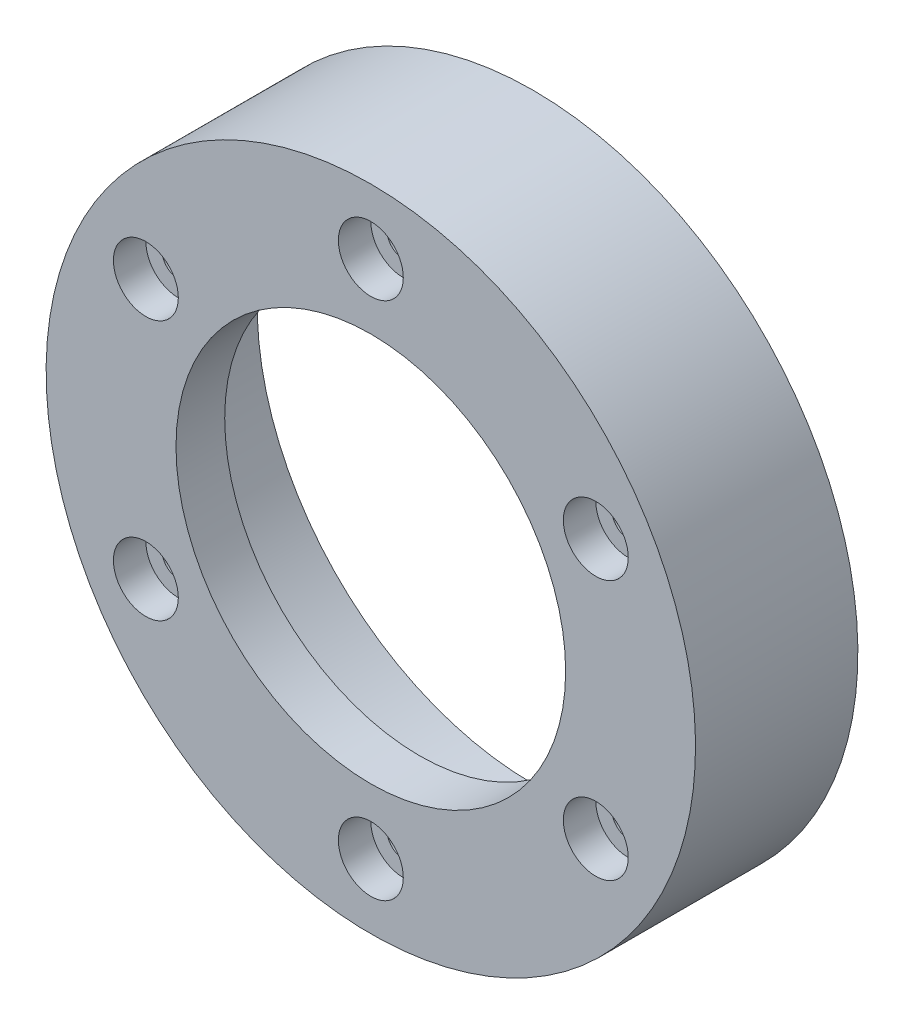
ISO-10303-21;
HEADER;
FILE_DESCRIPTION(('STEP AP214'),'2;1');
FILE_NAME('part.step','',(''),(''),'','','');
FILE_SCHEMA(('AUTOMOTIVE_DESIGN { 1 0 10303 214 1 1 1 1 }'));
ENDSEC;
DATA;
#1=APPLICATION_CONTEXT('core data for automotive mechanical design processes');
#2=APPLICATION_PROTOCOL_DEFINITION('international standard','automotive_design',2000,#1);
#3=PRODUCT_CONTEXT('',#1,'mechanical');
#4=PRODUCT('Part','Part','',(#3));
#5=PRODUCT_RELATED_PRODUCT_CATEGORY('part','',(#4));
#6=PRODUCT_DEFINITION_FORMATION('','',#4);
#7=PRODUCT_DEFINITION_CONTEXT('part definition',#1,'design');
#8=PRODUCT_DEFINITION('design','',#6,#7);
#9=PRODUCT_DEFINITION_SHAPE('','',#8);
#10=(LENGTH_UNIT() NAMED_UNIT(*) SI_UNIT(.MILLI.,.METRE.));
#11=(NAMED_UNIT(*) PLANE_ANGLE_UNIT() SI_UNIT($,.RADIAN.));
#12=(NAMED_UNIT(*) SI_UNIT($,.STERADIAN.) SOLID_ANGLE_UNIT());
#13=UNCERTAINTY_MEASURE_WITH_UNIT(LENGTH_MEASURE(1.E-05),#10,'distance_accuracy_value','');
#14=(GEOMETRIC_REPRESENTATION_CONTEXT(3) GLOBAL_UNCERTAINTY_ASSIGNED_CONTEXT((#13)) GLOBAL_UNIT_ASSIGNED_CONTEXT((#10,
#11,#12)) REPRESENTATION_CONTEXT('',''));
#15=CARTESIAN_POINT('',(0.,0.,0.));
#16=DIRECTION('',(0.,0.,1.));
#17=DIRECTION('',(1.,0.,0.));
#18=AXIS2_PLACEMENT_3D('',#15,#16,#17);
#19=CARTESIAN_POINT('',(0.,31.75,7.93750000000001));
#20=DIRECTION('',(0.,0.,1.));
#21=DIRECTION('',(0.,-1.,0.));
#22=AXIS2_PLACEMENT_3D('',#19,#20,#21);
#23=PLANE('',#22);
#24=CARTESIAN_POINT('',(0.,25.4,7.9375));
#25=DIRECTION('',(0.,0.,1.));
#26=DIRECTION('',(1.,0.,0.));
#27=AXIS2_PLACEMENT_3D('',#24,#25,#26);
#28=CIRCLE('',#27,3.175);
#29=CARTESIAN_POINT('',(3.175,25.4,7.9375));
#30=VERTEX_POINT('',#29);
#31=EDGE_CURVE('E201',#30,#30,#28,.T.);
#32=ORIENTED_EDGE('',*,*,#31,.F.);
#33=EDGE_LOOP('',(#32));
#34=FACE_BOUND('',#33,.T.);
#35=CARTESIAN_POINT('',(21.9970452561247,12.7,7.9375));
#36=DIRECTION('',(0.,0.,1.));
#37=DIRECTION('',(1.,0.,0.));
#38=AXIS2_PLACEMENT_3D('',#35,#36,#37);
#39=CIRCLE('',#38,3.175);
#40=CARTESIAN_POINT('',(25.1720452561247,12.7,7.9375));
#41=VERTEX_POINT('',#40);
#42=EDGE_CURVE('E208',#41,#41,#39,.T.);
#43=ORIENTED_EDGE('',*,*,#42,.F.);
#44=EDGE_LOOP('',(#43));
#45=FACE_BOUND('',#44,.T.);
#46=CARTESIAN_POINT('',(21.9970452561247,-12.7,7.9375));
#47=DIRECTION('',(0.,0.,1.));
#48=DIRECTION('',(1.,0.,0.));
#49=AXIS2_PLACEMENT_3D('',#46,#47,#48);
#50=CIRCLE('',#49,3.175);
#51=CARTESIAN_POINT('',(25.1720452561247,-12.7,7.9375));
#52=VERTEX_POINT('',#51);
#53=EDGE_CURVE('E219',#52,#52,#50,.T.);
#54=ORIENTED_EDGE('',*,*,#53,.F.);
#55=EDGE_LOOP('',(#54));
#56=FACE_BOUND('',#55,.T.);
#57=CARTESIAN_POINT('',(0.,-25.4,7.9375));
#58=DIRECTION('',(0.,0.,1.));
#59=DIRECTION('',(1.,0.,0.));
#60=AXIS2_PLACEMENT_3D('',#57,#58,#59);
#61=CIRCLE('',#60,3.175);
#62=CARTESIAN_POINT('',(3.175,-25.4,7.9375));
#63=VERTEX_POINT('',#62);
#64=EDGE_CURVE('E231',#63,#63,#61,.T.);
#65=ORIENTED_EDGE('',*,*,#64,.F.);
#66=EDGE_LOOP('',(#65));
#67=FACE_BOUND('',#66,.T.);
#68=CARTESIAN_POINT('',(-21.9970452561247,-12.7,7.9375));
#69=DIRECTION('',(0.,0.,1.));
#70=DIRECTION('',(1.,0.,0.));
#71=AXIS2_PLACEMENT_3D('',#68,#69,#70);
#72=CIRCLE('',#71,3.175);
#73=CARTESIAN_POINT('',(-18.8220452561247,-12.7,7.9375));
#74=VERTEX_POINT('',#73);
#75=EDGE_CURVE('E243',#74,#74,#72,.T.);
#76=ORIENTED_EDGE('',*,*,#75,.F.);
#77=EDGE_LOOP('',(#76));
#78=FACE_BOUND('',#77,.T.);
#79=CARTESIAN_POINT('',(-21.9970452561247,12.7,7.9375));
#80=DIRECTION('',(0.,0.,1.));
#81=DIRECTION('',(1.,0.,0.));
#82=AXIS2_PLACEMENT_3D('',#79,#80,#81);
#83=CIRCLE('',#82,3.175);
#84=CARTESIAN_POINT('',(-18.8220452561247,12.7,7.9375));
#85=VERTEX_POINT('',#84);
#86=EDGE_CURVE('E253',#85,#85,#83,.T.);
#87=ORIENTED_EDGE('',*,*,#86,.F.);
#88=EDGE_LOOP('',(#87));
#89=FACE_BOUND('',#88,.T.);
#90=CARTESIAN_POINT('',(0.,0.,7.9375));
#91=DIRECTION('',(0.,0.,-1.));
#92=DIRECTION('',(0.,1.,0.));
#93=AXIS2_PLACEMENT_3D('',#90,#91,#92);
#94=CIRCLE('',#93,19.05);
#95=CARTESIAN_POINT('',(0.,19.05,7.93750000000001));
#96=VERTEX_POINT('',#95);
#97=EDGE_CURVE('E85',#96,#96,#94,.T.);
#98=ORIENTED_EDGE('',*,*,#97,.T.);
#99=EDGE_LOOP('',(#98));
#100=FACE_BOUND('',#99,.T.);
#101=CARTESIAN_POINT('',(0.,0.,7.9375));
#102=DIRECTION('',(0.,0.,-1.));
#103=DIRECTION('',(0.,1.,0.));
#104=AXIS2_PLACEMENT_3D('',#101,#102,#103);
#105=CIRCLE('',#104,31.75);
#106=CARTESIAN_POINT('',(0.,31.75,7.93750000000001));
#107=VERTEX_POINT('',#106);
#108=EDGE_CURVE('E11',#107,#107,#105,.T.);
#109=ORIENTED_EDGE('',*,*,#108,.F.);
#110=EDGE_LOOP('',(#109));
#111=FACE_BOUND('',#110,.T.);
#112=ADVANCED_FACE('F33',(#34,#45,#56,#67,#78,#89,#100,#111),#23,.T.);
#113=CARTESIAN_POINT('',(0.,0.,-7.93750000000001));
#114=DIRECTION('',(0.,0.,-1.));
#115=DIRECTION('',(0.,1.,0.));
#116=AXIS2_PLACEMENT_3D('',#113,#114,#115);
#117=CYLINDRICAL_SURFACE('',#116,31.75);
#118=ORIENTED_EDGE('',*,*,#108,.T.);
#119=EDGE_LOOP('',(#118));
#120=FACE_BOUND('',#119,.T.);
#121=CARTESIAN_POINT('',(0.,0.,-7.9375));
#122=DIRECTION('',(0.,0.,-1.));
#123=DIRECTION('',(0.,1.,0.));
#124=AXIS2_PLACEMENT_3D('',#121,#122,#123);
#125=CIRCLE('',#124,31.75);
#126=CARTESIAN_POINT('',(0.,31.75,-7.93749999999999));
#127=VERTEX_POINT('',#126);
#128=EDGE_CURVE('E41',#127,#127,#125,.T.);
#129=ORIENTED_EDGE('',*,*,#128,.F.);
#130=EDGE_LOOP('',(#129));
#131=FACE_BOUND('',#130,.T.);
#132=ADVANCED_FACE('F106',(#120,#131),#117,.T.);
#133=CARTESIAN_POINT('',(0.,31.75,-7.93749999999999));
#134=DIRECTION('',(0.,0.,-1.));
#135=DIRECTION('',(0.,1.,0.));
#136=AXIS2_PLACEMENT_3D('',#133,#134,#135);
#137=PLANE('',#136);
#138=ORIENTED_EDGE('',*,*,#128,.T.);
#139=EDGE_LOOP('',(#138));
#140=FACE_BOUND('',#139,.T.);
#141=CARTESIAN_POINT('',(0.,0.,-7.93750000000001));
#142=DIRECTION('',(0.,0.,-1.));
#143=DIRECTION('',(0.,1.,0.));
#144=AXIS2_PLACEMENT_3D('',#141,#142,#143);
#145=CIRCLE('',#144,26.9875);
#146=CARTESIAN_POINT('',(0.,26.9875,-7.9375));
#147=VERTEX_POINT('',#146);
#148=EDGE_CURVE('E97',#147,#147,#145,.T.);
#149=ORIENTED_EDGE('',*,*,#148,.F.);
#150=EDGE_LOOP('',(#149));
#151=FACE_BOUND('',#150,.T.);
#152=ADVANCED_FACE('F103',(#140,#151),#137,.T.);
#153=CARTESIAN_POINT('',(0.,0.,-7.93750000000001));
#154=DIRECTION('',(0.,0.,-1.));
#155=DIRECTION('',(0.,1.,0.));
#156=AXIS2_PLACEMENT_3D('',#153,#154,#155);
#157=CYLINDRICAL_SURFACE('',#156,26.9875);
#158=CARTESIAN_POINT('',(0.,0.,3.175));
#159=DIRECTION('',(0.,0.,-1.));
#160=DIRECTION('',(0.,1.,0.));
#161=AXIS2_PLACEMENT_3D('',#158,#159,#160);
#162=CIRCLE('',#161,26.9875);
#163=CARTESIAN_POINT('',(0.,26.9875,3.17500000000001));
#164=VERTEX_POINT('',#163);
#165=CARTESIAN_POINT('',(23.3718605846325,13.49375,3.175));
#166=VERTEX_POINT('',#165);
#167=EDGE_CURVE('E51',#164,#166,#162,.T.);
#168=ORIENTED_EDGE('',*,*,#167,.F.);
#169=CARTESIAN_POINT('',(-23.3718605846325,13.49375,3.175));
#170=VERTEX_POINT('',#169);
#171=EDGE_CURVE('E81',#170,#164,#162,.T.);
#172=ORIENTED_EDGE('',*,*,#171,.F.);
#173=CARTESIAN_POINT('',(-23.3718605846325,-13.49375,3.17499999999999));
#174=VERTEX_POINT('',#173);
#175=EDGE_CURVE('E67',#174,#170,#162,.T.);
#176=ORIENTED_EDGE('',*,*,#175,.F.);
#177=CARTESIAN_POINT('',(0.,-26.9875,3.17499999999999));
#178=VERTEX_POINT('',#177);
#179=EDGE_CURVE('E78',#178,#174,#162,.T.);
#180=ORIENTED_EDGE('',*,*,#179,.F.);
#181=CARTESIAN_POINT('',(23.3718605846325,-13.49375,3.17499999999999));
#182=VERTEX_POINT('',#181);
#183=EDGE_CURVE('E277',#182,#178,#162,.T.);
#184=ORIENTED_EDGE('',*,*,#183,.F.);
#185=EDGE_CURVE('E280',#166,#182,#162,.T.);
#186=ORIENTED_EDGE('',*,*,#185,.F.);
#187=EDGE_LOOP('',(#168,#172,#176,#180,#184,#186));
#188=FACE_BOUND('',#187,.T.);
#189=ORIENTED_EDGE('',*,*,#148,.T.);
#190=EDGE_LOOP('',(#189));
#191=FACE_BOUND('',#190,.T.);
#192=ADVANCED_FACE('F113',(#188,#191),#157,.F.);
#193=CARTESIAN_POINT('',(0.,26.9875,3.17500000000001));
#194=DIRECTION('',(0.,0.,-1.));
#195=DIRECTION('',(0.,1.,0.));
#196=AXIS2_PLACEMENT_3D('',#193,#194,#195);
#197=PLANE('',#196);
#198=ORIENTED_EDGE('',*,*,#171,.T.);
#199=CARTESIAN_POINT('',(0.,25.4,3.17500000000001));
#200=DIRECTION('',(0.,0.,-1.));
#201=DIRECTION('',(0.,1.,0.));
#202=AXIS2_PLACEMENT_3D('',#199,#200,#201);
#203=CIRCLE('',#202,1.5875);
#204=EDGE_CURVE('E36',#164,#164,#203,.T.);
#205=ORIENTED_EDGE('',*,*,#204,.F.);
#206=ORIENTED_EDGE('',*,*,#167,.T.);
#207=CARTESIAN_POINT('',(21.9970452561247,12.7,3.175));
#208=DIRECTION('',(0.,0.,-1.));
#209=DIRECTION('',(0.,1.,0.));
#210=AXIS2_PLACEMENT_3D('',#207,#208,#209);
#211=CIRCLE('',#210,1.5875);
#212=EDGE_CURVE('E217',#166,#166,#211,.T.);
#213=ORIENTED_EDGE('',*,*,#212,.F.);
#214=ORIENTED_EDGE('',*,*,#185,.T.);
#215=CARTESIAN_POINT('',(21.9970452561247,-12.7,3.175));
#216=DIRECTION('',(0.,0.,-1.));
#217=DIRECTION('',(0.,1.,0.));
#218=AXIS2_PLACEMENT_3D('',#215,#216,#217);
#219=CIRCLE('',#218,1.5875);
#220=EDGE_CURVE('E228',#182,#182,#219,.T.);
#221=ORIENTED_EDGE('',*,*,#220,.F.);
#222=ORIENTED_EDGE('',*,*,#183,.T.);
#223=CARTESIAN_POINT('',(0.,-25.4,3.17499999999999));
#224=DIRECTION('',(0.,0.,-1.));
#225=DIRECTION('',(0.,1.,0.));
#226=AXIS2_PLACEMENT_3D('',#223,#224,#225);
#227=CIRCLE('',#226,1.5875);
#228=EDGE_CURVE('E240',#178,#178,#227,.T.);
#229=ORIENTED_EDGE('',*,*,#228,.F.);
#230=ORIENTED_EDGE('',*,*,#179,.T.);
#231=CARTESIAN_POINT('',(-21.9970452561247,-12.7,3.175));
#232=DIRECTION('',(0.,0.,-1.));
#233=DIRECTION('',(0.,1.,0.));
#234=AXIS2_PLACEMENT_3D('',#231,#232,#233);
#235=CIRCLE('',#234,1.5875);
#236=EDGE_CURVE('E75',#174,#174,#235,.T.);
#237=ORIENTED_EDGE('',*,*,#236,.F.);
#238=ORIENTED_EDGE('',*,*,#175,.T.);
#239=CARTESIAN_POINT('',(-21.9970452561247,12.7,3.175));
#240=DIRECTION('',(0.,0.,-1.));
#241=DIRECTION('',(0.,1.,0.));
#242=AXIS2_PLACEMENT_3D('',#239,#240,#241);
#243=CIRCLE('',#242,1.5875);
#244=EDGE_CURVE('E72',#170,#170,#243,.T.);
#245=ORIENTED_EDGE('',*,*,#244,.F.);
#246=EDGE_LOOP('',(#198,#205,#206,#213,#214,#221,#222,#229,#230,#237,#238,#245));
#247=FACE_BOUND('',#246,.T.);
#248=CARTESIAN_POINT('',(0.,0.,3.175));
#249=DIRECTION('',(0.,0.,-1.));
#250=DIRECTION('',(0.,1.,0.));
#251=AXIS2_PLACEMENT_3D('',#248,#249,#250);
#252=CIRCLE('',#251,19.05);
#253=CARTESIAN_POINT('',(0.,19.05,3.17500000000001));
#254=VERTEX_POINT('',#253);
#255=EDGE_CURVE('E79',#254,#254,#252,.T.);
#256=ORIENTED_EDGE('',*,*,#255,.F.);
#257=EDGE_LOOP('',(#256));
#258=FACE_BOUND('',#257,.T.);
#259=ADVANCED_FACE('F70',(#247,#258),#197,.T.);
#260=CARTESIAN_POINT('',(0.,0.,-7.93750000000001));
#261=DIRECTION('',(0.,0.,-1.));
#262=DIRECTION('',(0.,1.,0.));
#263=AXIS2_PLACEMENT_3D('',#260,#261,#262);
#264=CYLINDRICAL_SURFACE('',#263,19.05);
#265=ORIENTED_EDGE('',*,*,#255,.T.);
#266=EDGE_LOOP('',(#265));
#267=FACE_BOUND('',#266,.T.);
#268=ORIENTED_EDGE('',*,*,#97,.F.);
#269=EDGE_LOOP('',(#268));
#270=FACE_BOUND('',#269,.T.);
#271=ADVANCED_FACE('F121',(#267,#270),#264,.F.);
#272=CARTESIAN_POINT('',(-21.9970452561247,12.7,7.9375));
#273=DIRECTION('',(0.,0.,1.));
#274=DIRECTION('',(1.,0.,0.));
#275=AXIS2_PLACEMENT_3D('',#272,#273,#274);
#276=CYLINDRICAL_SURFACE('',#275,1.5875);
#277=ORIENTED_EDGE('',*,*,#244,.T.);
#278=EDGE_LOOP('',(#277));
#279=FACE_BOUND('',#278,.T.);
#280=CARTESIAN_POINT('',(-21.9970452561247,12.7,4.7625));
#281=DIRECTION('',(0.,0.,1.));
#282=DIRECTION('',(1.,0.,0.));
#283=AXIS2_PLACEMENT_3D('',#280,#281,#282);
#284=CIRCLE('',#283,1.5875);
#285=CARTESIAN_POINT('',(-20.4095452561247,12.7,4.7625));
#286=VERTEX_POINT('',#285);
#287=EDGE_CURVE('E86',#286,#286,#284,.T.);
#288=ORIENTED_EDGE('',*,*,#287,.T.);
#289=EDGE_LOOP('',(#288));
#290=FACE_BOUND('',#289,.T.);
#291=ADVANCED_FACE('F83',(#279,#290),#276,.F.);
#292=CARTESIAN_POINT('',(-20.4095452561247,12.7,4.7625));
#293=DIRECTION('',(0.,0.,-1.));
#294=DIRECTION('',(-1.,0.,0.));
#295=AXIS2_PLACEMENT_3D('',#292,#293,#294);
#296=PLANE('',#295);
#297=ORIENTED_EDGE('',*,*,#287,.F.);
#298=EDGE_LOOP('',(#297));
#299=FACE_BOUND('',#298,.T.);
#300=CARTESIAN_POINT('',(-21.9970452561247,12.7,4.7625));
#301=DIRECTION('',(0.,0.,1.));
#302=DIRECTION('',(1.,0.,0.));
#303=AXIS2_PLACEMENT_3D('',#300,#301,#302);
#304=CIRCLE('',#303,3.175);
#305=CARTESIAN_POINT('',(-18.8220452561247,12.7,4.7625));
#306=VERTEX_POINT('',#305);
#307=EDGE_CURVE('E91',#306,#306,#304,.T.);
#308=ORIENTED_EDGE('',*,*,#307,.T.);
#309=EDGE_LOOP('',(#308));
#310=FACE_BOUND('',#309,.T.);
#311=ADVANCED_FACE('F127',(#299,#310),#296,.F.);
#312=CARTESIAN_POINT('',(-21.9970452561247,12.7,7.9375));
#313=DIRECTION('',(0.,0.,1.));
#314=DIRECTION('',(1.,0.,0.));
#315=AXIS2_PLACEMENT_3D('',#312,#313,#314);
#316=CYLINDRICAL_SURFACE('',#315,3.175);
#317=ORIENTED_EDGE('',*,*,#307,.F.);
#318=EDGE_LOOP('',(#317));
#319=FACE_BOUND('',#318,.T.);
#320=ORIENTED_EDGE('',*,*,#86,.T.);
#321=EDGE_LOOP('',(#320));
#322=FACE_BOUND('',#321,.T.);
#323=ADVANCED_FACE('F130',(#319,#322),#316,.F.);
#324=CARTESIAN_POINT('',(-21.9970452561247,-12.7,7.9375));
#325=DIRECTION('',(0.,0.,1.));
#326=DIRECTION('',(1.,0.,0.));
#327=AXIS2_PLACEMENT_3D('',#324,#325,#326);
#328=CYLINDRICAL_SURFACE('',#327,1.5875);
#329=ORIENTED_EDGE('',*,*,#236,.T.);
#330=EDGE_LOOP('',(#329));
#331=FACE_BOUND('',#330,.T.);
#332=CARTESIAN_POINT('',(-21.9970452561247,-12.7,4.7625));
#333=DIRECTION('',(0.,0.,1.));
#334=DIRECTION('',(1.,0.,0.));
#335=AXIS2_PLACEMENT_3D('',#332,#333,#334);
#336=CIRCLE('',#335,1.5875);
#337=CARTESIAN_POINT('',(-20.4095452561247,-12.7,4.7625));
#338=VERTEX_POINT('',#337);
#339=EDGE_CURVE('E249',#338,#338,#336,.T.);
#340=ORIENTED_EDGE('',*,*,#339,.T.);
#341=EDGE_LOOP('',(#340));
#342=FACE_BOUND('',#341,.T.);
#343=ADVANCED_FACE('F134',(#331,#342),#328,.F.);
#344=CARTESIAN_POINT('',(-20.4095452561247,-12.7,4.7625));
#345=DIRECTION('',(0.,0.,-1.));
#346=DIRECTION('',(-1.,0.,0.));
#347=AXIS2_PLACEMENT_3D('',#344,#345,#346);
#348=PLANE('',#347);
#349=ORIENTED_EDGE('',*,*,#339,.F.);
#350=EDGE_LOOP('',(#349));
#351=FACE_BOUND('',#350,.T.);
#352=CARTESIAN_POINT('',(-21.9970452561247,-12.7,4.7625));
#353=DIRECTION('',(0.,0.,1.));
#354=DIRECTION('',(1.,0.,0.));
#355=AXIS2_PLACEMENT_3D('',#352,#353,#354);
#356=CIRCLE('',#355,3.175);
#357=CARTESIAN_POINT('',(-18.8220452561247,-12.7,4.7625));
#358=VERTEX_POINT('',#357);
#359=EDGE_CURVE('E246',#358,#358,#356,.T.);
#360=ORIENTED_EDGE('',*,*,#359,.T.);
#361=EDGE_LOOP('',(#360));
#362=FACE_BOUND('',#361,.T.);
#363=ADVANCED_FACE('F138',(#351,#362),#348,.F.);
#364=CARTESIAN_POINT('',(-21.9970452561247,-12.7,7.9375));
#365=DIRECTION('',(0.,0.,1.));
#366=DIRECTION('',(1.,0.,0.));
#367=AXIS2_PLACEMENT_3D('',#364,#365,#366);
#368=CYLINDRICAL_SURFACE('',#367,3.175);
#369=ORIENTED_EDGE('',*,*,#359,.F.);
#370=EDGE_LOOP('',(#369));
#371=FACE_BOUND('',#370,.T.);
#372=ORIENTED_EDGE('',*,*,#75,.T.);
#373=EDGE_LOOP('',(#372));
#374=FACE_BOUND('',#373,.T.);
#375=ADVANCED_FACE('F142',(#371,#374),#368,.F.);
#376=CARTESIAN_POINT('',(0.,-25.4,7.9375));
#377=DIRECTION('',(0.,0.,1.));
#378=DIRECTION('',(1.,0.,0.));
#379=AXIS2_PLACEMENT_3D('',#376,#377,#378);
#380=CYLINDRICAL_SURFACE('',#379,1.5875);
#381=ORIENTED_EDGE('',*,*,#228,.T.);
#382=EDGE_LOOP('',(#381));
#383=FACE_BOUND('',#382,.T.);
#384=CARTESIAN_POINT('',(0.,-25.4,4.7625));
#385=DIRECTION('',(0.,0.,1.));
#386=DIRECTION('',(1.,0.,0.));
#387=AXIS2_PLACEMENT_3D('',#384,#385,#386);
#388=CIRCLE('',#387,1.5875);
#389=CARTESIAN_POINT('',(1.5875,-25.4,4.7625));
#390=VERTEX_POINT('',#389);
#391=EDGE_CURVE('E237',#390,#390,#388,.T.);
#392=ORIENTED_EDGE('',*,*,#391,.T.);
#393=EDGE_LOOP('',(#392));
#394=FACE_BOUND('',#393,.T.);
#395=ADVANCED_FACE('F146',(#383,#394),#380,.F.);
#396=CARTESIAN_POINT('',(1.5875,-25.4,4.7625));
#397=DIRECTION('',(0.,0.,-1.));
#398=DIRECTION('',(-1.,0.,0.));
#399=AXIS2_PLACEMENT_3D('',#396,#397,#398);
#400=PLANE('',#399);
#401=ORIENTED_EDGE('',*,*,#391,.F.);
#402=EDGE_LOOP('',(#401));
#403=FACE_BOUND('',#402,.T.);
#404=CARTESIAN_POINT('',(0.,-25.4,4.7625));
#405=DIRECTION('',(0.,0.,1.));
#406=DIRECTION('',(1.,0.,0.));
#407=AXIS2_PLACEMENT_3D('',#404,#405,#406);
#408=CIRCLE('',#407,3.175);
#409=CARTESIAN_POINT('',(3.175,-25.4,4.7625));
#410=VERTEX_POINT('',#409);
#411=EDGE_CURVE('E234',#410,#410,#408,.T.);
#412=ORIENTED_EDGE('',*,*,#411,.T.);
#413=EDGE_LOOP('',(#412));
#414=FACE_BOUND('',#413,.T.);
#415=ADVANCED_FACE('F150',(#403,#414),#400,.F.);
#416=CARTESIAN_POINT('',(0.,-25.4,7.9375));
#417=DIRECTION('',(0.,0.,1.));
#418=DIRECTION('',(1.,0.,0.));
#419=AXIS2_PLACEMENT_3D('',#416,#417,#418);
#420=CYLINDRICAL_SURFACE('',#419,3.175);
#421=ORIENTED_EDGE('',*,*,#411,.F.);
#422=EDGE_LOOP('',(#421));
#423=FACE_BOUND('',#422,.T.);
#424=ORIENTED_EDGE('',*,*,#64,.T.);
#425=EDGE_LOOP('',(#424));
#426=FACE_BOUND('',#425,.T.);
#427=ADVANCED_FACE('F154',(#423,#426),#420,.F.);
#428=CARTESIAN_POINT('',(21.9970452561247,-12.7,7.9375));
#429=DIRECTION('',(0.,0.,1.));
#430=DIRECTION('',(1.,0.,0.));
#431=AXIS2_PLACEMENT_3D('',#428,#429,#430);
#432=CYLINDRICAL_SURFACE('',#431,1.5875);
#433=ORIENTED_EDGE('',*,*,#220,.T.);
#434=EDGE_LOOP('',(#433));
#435=FACE_BOUND('',#434,.T.);
#436=CARTESIAN_POINT('',(21.9970452561247,-12.7,4.7625));
#437=DIRECTION('',(0.,0.,1.));
#438=DIRECTION('',(1.,0.,0.));
#439=AXIS2_PLACEMENT_3D('',#436,#437,#438);
#440=CIRCLE('',#439,1.5875);
#441=CARTESIAN_POINT('',(23.5845452561247,-12.7,4.7625));
#442=VERTEX_POINT('',#441);
#443=EDGE_CURVE('E225',#442,#442,#440,.T.);
#444=ORIENTED_EDGE('',*,*,#443,.T.);
#445=EDGE_LOOP('',(#444));
#446=FACE_BOUND('',#445,.T.);
#447=ADVANCED_FACE('F158',(#435,#446),#432,.F.);
#448=CARTESIAN_POINT('',(23.5845452561247,-12.7,4.7625));
#449=DIRECTION('',(0.,0.,-1.));
#450=DIRECTION('',(-1.,0.,0.));
#451=AXIS2_PLACEMENT_3D('',#448,#449,#450);
#452=PLANE('',#451);
#453=ORIENTED_EDGE('',*,*,#443,.F.);
#454=EDGE_LOOP('',(#453));
#455=FACE_BOUND('',#454,.T.);
#456=CARTESIAN_POINT('',(21.9970452561247,-12.7,4.7625));
#457=DIRECTION('',(0.,0.,1.));
#458=DIRECTION('',(1.,0.,0.));
#459=AXIS2_PLACEMENT_3D('',#456,#457,#458);
#460=CIRCLE('',#459,3.175);
#461=CARTESIAN_POINT('',(25.1720452561247,-12.7,4.7625));
#462=VERTEX_POINT('',#461);
#463=EDGE_CURVE('E222',#462,#462,#460,.T.);
#464=ORIENTED_EDGE('',*,*,#463,.T.);
#465=EDGE_LOOP('',(#464));
#466=FACE_BOUND('',#465,.T.);
#467=ADVANCED_FACE('F162',(#455,#466),#452,.F.);
#468=CARTESIAN_POINT('',(21.9970452561247,-12.7,7.9375));
#469=DIRECTION('',(0.,0.,1.));
#470=DIRECTION('',(1.,0.,0.));
#471=AXIS2_PLACEMENT_3D('',#468,#469,#470);
#472=CYLINDRICAL_SURFACE('',#471,3.175);
#473=ORIENTED_EDGE('',*,*,#463,.F.);
#474=EDGE_LOOP('',(#473));
#475=FACE_BOUND('',#474,.T.);
#476=ORIENTED_EDGE('',*,*,#53,.T.);
#477=EDGE_LOOP('',(#476));
#478=FACE_BOUND('',#477,.T.);
#479=ADVANCED_FACE('F166',(#475,#478),#472,.F.);
#480=CARTESIAN_POINT('',(21.9970452561247,12.7,7.9375));
#481=DIRECTION('',(0.,0.,1.));
#482=DIRECTION('',(1.,0.,0.));
#483=AXIS2_PLACEMENT_3D('',#480,#481,#482);
#484=CYLINDRICAL_SURFACE('',#483,1.5875);
#485=ORIENTED_EDGE('',*,*,#212,.T.);
#486=EDGE_LOOP('',(#485));
#487=FACE_BOUND('',#486,.T.);
#488=CARTESIAN_POINT('',(21.9970452561247,12.7,4.7625));
#489=DIRECTION('',(0.,0.,1.));
#490=DIRECTION('',(1.,0.,0.));
#491=AXIS2_PLACEMENT_3D('',#488,#489,#490);
#492=CIRCLE('',#491,1.5875);
#493=CARTESIAN_POINT('',(23.5845452561247,12.7,4.7625));
#494=VERTEX_POINT('',#493);
#495=EDGE_CURVE('E214',#494,#494,#492,.T.);
#496=ORIENTED_EDGE('',*,*,#495,.T.);
#497=EDGE_LOOP('',(#496));
#498=FACE_BOUND('',#497,.T.);
#499=ADVANCED_FACE('F170',(#487,#498),#484,.F.);
#500=CARTESIAN_POINT('',(23.5845452561247,12.7,4.7625));
#501=DIRECTION('',(0.,0.,-1.));
#502=DIRECTION('',(-1.,0.,0.));
#503=AXIS2_PLACEMENT_3D('',#500,#501,#502);
#504=PLANE('',#503);
#505=ORIENTED_EDGE('',*,*,#495,.F.);
#506=EDGE_LOOP('',(#505));
#507=FACE_BOUND('',#506,.T.);
#508=CARTESIAN_POINT('',(21.9970452561247,12.7,4.7625));
#509=DIRECTION('',(0.,0.,1.));
#510=DIRECTION('',(1.,0.,0.));
#511=AXIS2_PLACEMENT_3D('',#508,#509,#510);
#512=CIRCLE('',#511,3.175);
#513=CARTESIAN_POINT('',(25.1720452561247,12.7,4.7625));
#514=VERTEX_POINT('',#513);
#515=EDGE_CURVE('E211',#514,#514,#512,.T.);
#516=ORIENTED_EDGE('',*,*,#515,.T.);
#517=EDGE_LOOP('',(#516));
#518=FACE_BOUND('',#517,.T.);
#519=ADVANCED_FACE('F174',(#507,#518),#504,.F.);
#520=CARTESIAN_POINT('',(21.9970452561247,12.7,7.9375));
#521=DIRECTION('',(0.,0.,1.));
#522=DIRECTION('',(1.,0.,0.));
#523=AXIS2_PLACEMENT_3D('',#520,#521,#522);
#524=CYLINDRICAL_SURFACE('',#523,3.175);
#525=ORIENTED_EDGE('',*,*,#515,.F.);
#526=EDGE_LOOP('',(#525));
#527=FACE_BOUND('',#526,.T.);
#528=ORIENTED_EDGE('',*,*,#42,.T.);
#529=EDGE_LOOP('',(#528));
#530=FACE_BOUND('',#529,.T.);
#531=ADVANCED_FACE('F178',(#527,#530),#524,.F.);
#532=CARTESIAN_POINT('',(0.,25.4,7.9375));
#533=DIRECTION('',(0.,0.,1.));
#534=DIRECTION('',(1.,0.,0.));
#535=AXIS2_PLACEMENT_3D('',#532,#533,#534);
#536=CYLINDRICAL_SURFACE('',#535,1.5875);
#537=ORIENTED_EDGE('',*,*,#204,.T.);
#538=EDGE_LOOP('',(#537));
#539=FACE_BOUND('',#538,.T.);
#540=CARTESIAN_POINT('',(0.,25.4,4.7625));
#541=DIRECTION('',(0.,0.,1.));
#542=DIRECTION('',(1.,0.,0.));
#543=AXIS2_PLACEMENT_3D('',#540,#541,#542);
#544=CIRCLE('',#543,1.5875);
#545=CARTESIAN_POINT('',(1.5875,25.4,4.7625));
#546=VERTEX_POINT('',#545);
#547=EDGE_CURVE('E203',#546,#546,#544,.T.);
#548=ORIENTED_EDGE('',*,*,#547,.T.);
#549=EDGE_LOOP('',(#548));
#550=FACE_BOUND('',#549,.T.);
#551=ADVANCED_FACE('F182',(#539,#550),#536,.F.);
#552=CARTESIAN_POINT('',(1.5875,25.4,4.7625));
#553=DIRECTION('',(0.,0.,-1.));
#554=DIRECTION('',(-1.,0.,0.));
#555=AXIS2_PLACEMENT_3D('',#552,#553,#554);
#556=PLANE('',#555);
#557=ORIENTED_EDGE('',*,*,#547,.F.);
#558=EDGE_LOOP('',(#557));
#559=FACE_BOUND('',#558,.T.);
#560=CARTESIAN_POINT('',(0.,25.4,4.7625));
#561=DIRECTION('',(0.,0.,1.));
#562=DIRECTION('',(1.,0.,0.));
#563=AXIS2_PLACEMENT_3D('',#560,#561,#562);
#564=CIRCLE('',#563,3.175);
#565=CARTESIAN_POINT('',(3.175,25.4,4.7625));
#566=VERTEX_POINT('',#565);
#567=EDGE_CURVE('E198',#566,#566,#564,.T.);
#568=ORIENTED_EDGE('',*,*,#567,.T.);
#569=EDGE_LOOP('',(#568));
#570=FACE_BOUND('',#569,.T.);
#571=ADVANCED_FACE('F186',(#559,#570),#556,.F.);
#572=CARTESIAN_POINT('',(0.,25.4,7.9375));
#573=DIRECTION('',(0.,0.,1.));
#574=DIRECTION('',(1.,0.,0.));
#575=AXIS2_PLACEMENT_3D('',#572,#573,#574);
#576=CYLINDRICAL_SURFACE('',#575,3.175);
#577=ORIENTED_EDGE('',*,*,#567,.F.);
#578=EDGE_LOOP('',(#577));
#579=FACE_BOUND('',#578,.T.);
#580=ORIENTED_EDGE('',*,*,#31,.T.);
#581=EDGE_LOOP('',(#580));
#582=FACE_BOUND('',#581,.T.);
#583=ADVANCED_FACE('F189',(#579,#582),#576,.F.);
#584=CLOSED_SHELL('',(#112,#132,#152,#192,#259,#271,#291,#311,#323,#343,#363,#375,#395,#415,
#427,#447,#467,#479,#499,#519,#531,#551,#571,#583));
#585=MANIFOLD_SOLID_BREP('B2',#584);
#586=ADVANCED_BREP_SHAPE_REPRESENTATION('',(#18,#585),#14);
#587=SHAPE_DEFINITION_REPRESENTATION(#9,#586);
ENDSEC;
END-ISO-10303-21;
